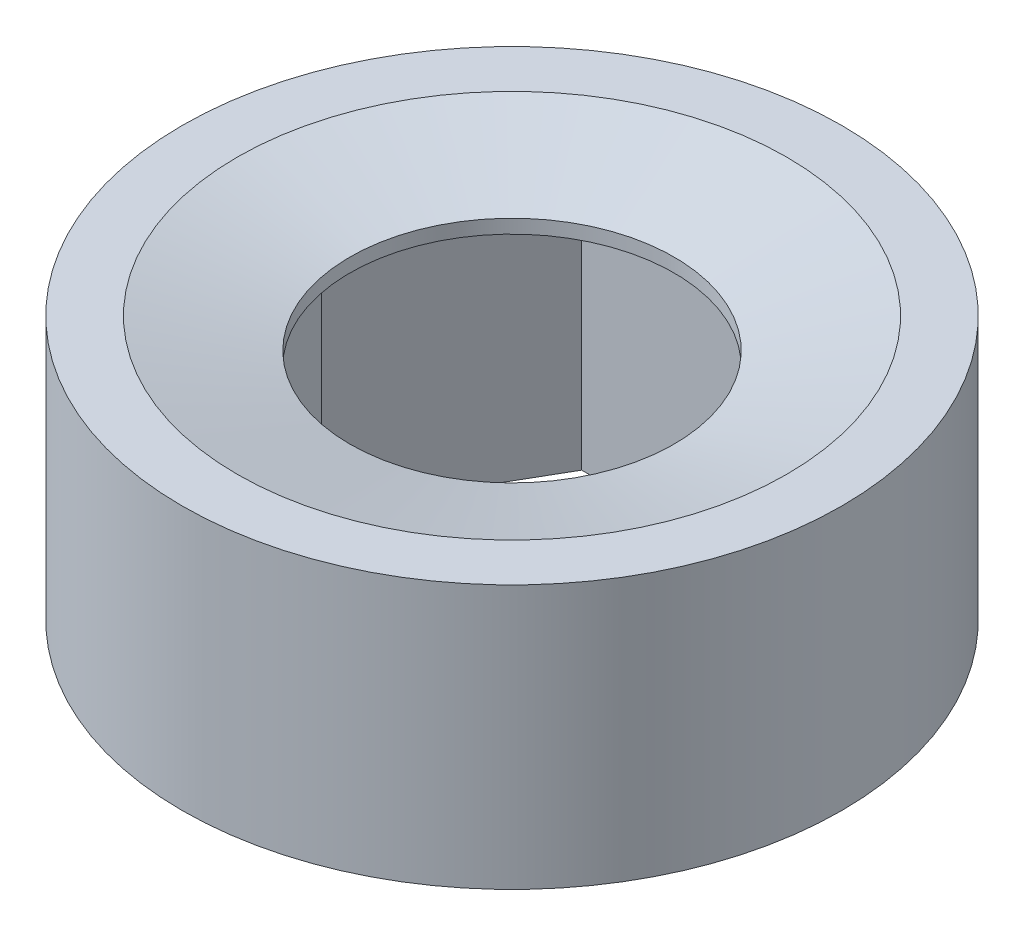
ISO-10303-21;
HEADER;
FILE_DESCRIPTION(('STEP AP214'),'2;1');
FILE_NAME('part.step','',(''),(''),'','','');
FILE_SCHEMA(('AUTOMOTIVE_DESIGN { 1 0 10303 214 1 1 1 1 }'));
ENDSEC;
DATA;
#1=APPLICATION_CONTEXT('core data for automotive mechanical design processes');
#2=APPLICATION_PROTOCOL_DEFINITION('international standard','automotive_design',2000,#1);
#3=PRODUCT_CONTEXT('',#1,'mechanical');
#4=PRODUCT('Part','Part','',(#3));
#5=PRODUCT_RELATED_PRODUCT_CATEGORY('part','',(#4));
#6=PRODUCT_DEFINITION_FORMATION('','',#4);
#7=PRODUCT_DEFINITION_CONTEXT('part definition',#1,'design');
#8=PRODUCT_DEFINITION('design','',#6,#7);
#9=PRODUCT_DEFINITION_SHAPE('','',#8);
#10=(LENGTH_UNIT() NAMED_UNIT(*) SI_UNIT(.MILLI.,.METRE.));
#11=(NAMED_UNIT(*) PLANE_ANGLE_UNIT() SI_UNIT($,.RADIAN.));
#12=(NAMED_UNIT(*) SI_UNIT($,.STERADIAN.) SOLID_ANGLE_UNIT());
#13=UNCERTAINTY_MEASURE_WITH_UNIT(LENGTH_MEASURE(1.E-05),#10,'distance_accuracy_value','');
#14=(GEOMETRIC_REPRESENTATION_CONTEXT(3) GLOBAL_UNCERTAINTY_ASSIGNED_CONTEXT((#13)) GLOBAL_UNIT_ASSIGNED_CONTEXT((#10,
#11,#12)) REPRESENTATION_CONTEXT('',''));
#15=CARTESIAN_POINT('',(0.,0.,0.));
#16=DIRECTION('',(0.,0.,1.));
#17=DIRECTION('',(1.,0.,0.));
#18=AXIS2_PLACEMENT_3D('',#15,#16,#17);
#19=CARTESIAN_POINT('',(0.,0.,0.));
#20=DIRECTION('',(0.,1.,0.));
#21=DIRECTION('',(0.,0.,1.));
#22=AXIS2_PLACEMENT_3D('',#19,#20,#21);
#23=PLANE('',#22);
#24=CARTESIAN_POINT('',(0.,0.,0.));
#25=DIRECTION('',(0.,1.,0.));
#26=DIRECTION('',(0.,0.,1.));
#27=AXIS2_PLACEMENT_3D('',#24,#25,#26);
#28=CIRCLE('',#27,12.);
#29=CARTESIAN_POINT('',(0.,0.,12.));
#30=VERTEX_POINT('',#29);
#31=EDGE_CURVE('E11',#30,#30,#28,.T.);
#32=ORIENTED_EDGE('',*,*,#31,.F.);
#33=EDGE_LOOP('',(#32));
#34=FACE_BOUND('',#33,.T.);
#35=DIRECTION('',(-0.5,0.,-0.866025403784438));
#36=VECTOR('',#35,1.);
#37=CARTESIAN_POINT('',(6.92820323027551,0.,0.));
#38=LINE('',#37,#36);
#39=CARTESIAN_POINT('',(6.92820323027551,0.,0.));
#40=VERTEX_POINT('',#39);
#41=CARTESIAN_POINT('',(3.46410161513775,0.,-6.));
#42=VERTEX_POINT('',#41);
#43=EDGE_CURVE('E56',#40,#42,#38,.T.);
#44=ORIENTED_EDGE('',*,*,#43,.T.);
#45=DIRECTION('',(-1.,0.,0.));
#46=VECTOR('',#45,1.);
#47=CARTESIAN_POINT('',(3.46410161513775,0.,-6.));
#48=LINE('',#47,#46);
#49=CARTESIAN_POINT('',(-3.46410161513775,0.,-6.));
#50=VERTEX_POINT('',#49);
#51=EDGE_CURVE('E118',#42,#50,#48,.T.);
#52=ORIENTED_EDGE('',*,*,#51,.T.);
#53=DIRECTION('',(-0.5,0.,0.866025403784439));
#54=VECTOR('',#53,1.);
#55=CARTESIAN_POINT('',(-3.46410161513775,0.,-6.));
#56=LINE('',#55,#54);
#57=CARTESIAN_POINT('',(-6.92820323027551,0.,0.));
#58=VERTEX_POINT('',#57);
#59=EDGE_CURVE('E112',#50,#58,#56,.T.);
#60=ORIENTED_EDGE('',*,*,#59,.T.);
#61=DIRECTION('',(0.5,0.,0.866025403784438));
#62=VECTOR('',#61,1.);
#63=CARTESIAN_POINT('',(-6.92820323027551,0.,0.));
#64=LINE('',#63,#62);
#65=CARTESIAN_POINT('',(-3.46410161513775,0.,6.));
#66=VERTEX_POINT('',#65);
#67=EDGE_CURVE('E91',#58,#66,#64,.T.);
#68=ORIENTED_EDGE('',*,*,#67,.T.);
#69=DIRECTION('',(1.,0.,0.));
#70=VECTOR('',#69,1.);
#71=CARTESIAN_POINT('',(-3.46410161513775,0.,6.));
#72=LINE('',#71,#70);
#73=CARTESIAN_POINT('',(3.46410161513776,0.,6.));
#74=VERTEX_POINT('',#73);
#75=EDGE_CURVE('E101',#66,#74,#72,.T.);
#76=ORIENTED_EDGE('',*,*,#75,.T.);
#77=DIRECTION('',(0.5,0.,-0.866025403784439));
#78=VECTOR('',#77,1.);
#79=CARTESIAN_POINT('',(3.46410161513776,0.,6.));
#80=LINE('',#79,#78);
#81=EDGE_CURVE('E108',#74,#40,#80,.T.);
#82=ORIENTED_EDGE('',*,*,#81,.T.);
#83=EDGE_LOOP('',(#44,#52,#60,#68,#76,#82));
#84=FACE_BOUND('',#83,.T.);
#85=ADVANCED_FACE('F39',(#34,#84),#23,.F.);
#86=CARTESIAN_POINT('',(0.,8.,0.));
#87=DIRECTION('',(0.,-1.,0.));
#88=DIRECTION('',(0.,0.,-1.));
#89=AXIS2_PLACEMENT_3D('',#86,#87,#88);
#90=CYLINDRICAL_SURFACE('',#89,12.);
#91=ORIENTED_EDGE('',*,*,#31,.T.);
#92=EDGE_LOOP('',(#91));
#93=FACE_BOUND('',#92,.T.);
#94=CARTESIAN_POINT('',(0.,9.6,0.));
#95=DIRECTION('',(0.,1.,0.));
#96=DIRECTION('',(0.,0.,1.));
#97=AXIS2_PLACEMENT_3D('',#94,#95,#96);
#98=CIRCLE('',#97,12.);
#99=CARTESIAN_POINT('',(0.,9.6,12.));
#100=VERTEX_POINT('',#99);
#101=EDGE_CURVE('E144',#100,#100,#98,.T.);
#102=ORIENTED_EDGE('',*,*,#101,.F.);
#103=EDGE_LOOP('',(#102));
#104=FACE_BOUND('',#103,.T.);
#105=ADVANCED_FACE('F41',(#93,#104),#90,.T.);
#106=CARTESIAN_POINT('',(6.92820323027551,8.,0.));
#107=DIRECTION('',(-0.866025403784439,0.,0.5));
#108=DIRECTION('',(0.5,0.,0.866025403784438));
#109=AXIS2_PLACEMENT_3D('',#106,#107,#108);
#110=PLANE('',#109);
#111=ORIENTED_EDGE('',*,*,#43,.F.);
#112=DIRECTION('',(0.,-1.,0.));
#113=VECTOR('',#112,1.);
#114=CARTESIAN_POINT('',(6.92820323027551,8.,0.));
#115=LINE('',#114,#113);
#116=CARTESIAN_POINT('',(6.92820323027551,8.,0.));
#117=VERTEX_POINT('',#116);
#118=EDGE_CURVE('E125',#117,#40,#115,.T.);
#119=ORIENTED_EDGE('',*,*,#118,.F.);
#120=DIRECTION('',(-0.5,0.,-0.866025403784438));
#121=VECTOR('',#120,1.);
#122=CARTESIAN_POINT('',(6.92820323027551,8.,0.));
#123=LINE('',#122,#121);
#124=CARTESIAN_POINT('',(3.46410161513775,8.,-6.));
#125=VERTEX_POINT('',#124);
#126=EDGE_CURVE('E124',#117,#125,#123,.T.);
#127=ORIENTED_EDGE('',*,*,#126,.T.);
#128=DIRECTION('',(0.,-1.,0.));
#129=VECTOR('',#128,1.);
#130=CARTESIAN_POINT('',(3.46410161513775,8.,-6.));
#131=LINE('',#130,#129);
#132=EDGE_CURVE('E49',#125,#42,#131,.T.);
#133=ORIENTED_EDGE('',*,*,#132,.T.);
#134=EDGE_LOOP('',(#111,#119,#127,#133));
#135=FACE_BOUND('',#134,.T.);
#136=ADVANCED_FACE('F139',(#135),#110,.T.);
#137=CARTESIAN_POINT('',(3.46410161513775,8.,-6.));
#138=DIRECTION('',(0.,0.,1.));
#139=DIRECTION('',(1.,0.,0.));
#140=AXIS2_PLACEMENT_3D('',#137,#138,#139);
#141=PLANE('',#140);
#142=ORIENTED_EDGE('',*,*,#51,.F.);
#143=ORIENTED_EDGE('',*,*,#132,.F.);
#144=DIRECTION('',(-1.,0.,0.));
#145=VECTOR('',#144,1.);
#146=CARTESIAN_POINT('',(3.46410161513775,8.,-6.));
#147=LINE('',#146,#145);
#148=CARTESIAN_POINT('',(-3.46410161513775,8.,-6.));
#149=VERTEX_POINT('',#148);
#150=EDGE_CURVE('E163',#125,#149,#147,.T.);
#151=ORIENTED_EDGE('',*,*,#150,.T.);
#152=DIRECTION('',(0.,-1.,0.));
#153=VECTOR('',#152,1.);
#154=CARTESIAN_POINT('',(-3.46410161513775,8.,-6.));
#155=LINE('',#154,#153);
#156=EDGE_CURVE('E133',#149,#50,#155,.T.);
#157=ORIENTED_EDGE('',*,*,#156,.T.);
#158=EDGE_LOOP('',(#142,#143,#151,#157));
#159=FACE_BOUND('',#158,.T.);
#160=ADVANCED_FACE('F208',(#159),#141,.T.);
#161=CARTESIAN_POINT('',(-3.46410161513775,8.,-6.));
#162=DIRECTION('',(0.866025403784439,0.,0.5));
#163=DIRECTION('',(0.5,0.,-0.866025403784439));
#164=AXIS2_PLACEMENT_3D('',#161,#162,#163);
#165=PLANE('',#164);
#166=ORIENTED_EDGE('',*,*,#59,.F.);
#167=ORIENTED_EDGE('',*,*,#156,.F.);
#168=DIRECTION('',(-0.5,0.,0.866025403784439));
#169=VECTOR('',#168,1.);
#170=CARTESIAN_POINT('',(-3.46410161513775,8.,-6.));
#171=LINE('',#170,#169);
#172=CARTESIAN_POINT('',(-6.92820323027551,8.,0.));
#173=VERTEX_POINT('',#172);
#174=EDGE_CURVE('E160',#149,#173,#171,.T.);
#175=ORIENTED_EDGE('',*,*,#174,.T.);
#176=DIRECTION('',(0.,-1.,0.));
#177=VECTOR('',#176,1.);
#178=CARTESIAN_POINT('',(-6.92820323027551,8.,0.));
#179=LINE('',#178,#177);
#180=EDGE_CURVE('E97',#173,#58,#179,.T.);
#181=ORIENTED_EDGE('',*,*,#180,.T.);
#182=EDGE_LOOP('',(#166,#167,#175,#181));
#183=FACE_BOUND('',#182,.T.);
#184=ADVANCED_FACE('F211',(#183),#165,.T.);
#185=CARTESIAN_POINT('',(-6.92820323027551,8.,0.));
#186=DIRECTION('',(0.866025403784438,0.,-0.5));
#187=DIRECTION('',(-0.5,0.,-0.866025403784439));
#188=AXIS2_PLACEMENT_3D('',#185,#186,#187);
#189=PLANE('',#188);
#190=ORIENTED_EDGE('',*,*,#67,.F.);
#191=ORIENTED_EDGE('',*,*,#180,.F.);
#192=DIRECTION('',(0.5,0.,0.866025403784438));
#193=VECTOR('',#192,1.);
#194=CARTESIAN_POINT('',(-6.92820323027551,8.,0.));
#195=LINE('',#194,#193);
#196=CARTESIAN_POINT('',(-3.46410161513775,8.,6.));
#197=VERTEX_POINT('',#196);
#198=EDGE_CURVE('E65',#173,#197,#195,.T.);
#199=ORIENTED_EDGE('',*,*,#198,.T.);
#200=DIRECTION('',(0.,-1.,0.));
#201=VECTOR('',#200,1.);
#202=CARTESIAN_POINT('',(-3.46410161513775,8.,6.));
#203=LINE('',#202,#201);
#204=EDGE_CURVE('E86',#197,#66,#203,.T.);
#205=ORIENTED_EDGE('',*,*,#204,.T.);
#206=EDGE_LOOP('',(#190,#191,#199,#205));
#207=FACE_BOUND('',#206,.T.);
#208=ADVANCED_FACE('F88',(#207),#189,.T.);
#209=CARTESIAN_POINT('',(-3.46410161513775,8.,6.));
#210=DIRECTION('',(0.,0.,-1.));
#211=DIRECTION('',(-1.,0.,0.));
#212=AXIS2_PLACEMENT_3D('',#209,#210,#211);
#213=PLANE('',#212);
#214=ORIENTED_EDGE('',*,*,#75,.F.);
#215=ORIENTED_EDGE('',*,*,#204,.F.);
#216=DIRECTION('',(1.,0.,0.));
#217=VECTOR('',#216,1.);
#218=CARTESIAN_POINT('',(-3.46410161513775,8.,6.));
#219=LINE('',#218,#217);
#220=CARTESIAN_POINT('',(3.46410161513776,8.,6.));
#221=VERTEX_POINT('',#220);
#222=EDGE_CURVE('E155',#197,#221,#219,.T.);
#223=ORIENTED_EDGE('',*,*,#222,.T.);
#224=DIRECTION('',(0.,-1.,0.));
#225=VECTOR('',#224,1.);
#226=CARTESIAN_POINT('',(3.46410161513776,8.,6.));
#227=LINE('',#226,#225);
#228=EDGE_CURVE('E98',#221,#74,#227,.T.);
#229=ORIENTED_EDGE('',*,*,#228,.T.);
#230=EDGE_LOOP('',(#214,#215,#223,#229));
#231=FACE_BOUND('',#230,.T.);
#232=ADVANCED_FACE('F102',(#231),#213,.T.);
#233=CARTESIAN_POINT('',(3.46410161513776,8.,6.));
#234=DIRECTION('',(-0.866025403784439,0.,-0.5));
#235=DIRECTION('',(-0.5,0.,0.866025403784439));
#236=AXIS2_PLACEMENT_3D('',#233,#234,#235);
#237=PLANE('',#236);
#238=ORIENTED_EDGE('',*,*,#81,.F.);
#239=ORIENTED_EDGE('',*,*,#228,.F.);
#240=DIRECTION('',(0.5,0.,-0.866025403784439));
#241=VECTOR('',#240,1.);
#242=CARTESIAN_POINT('',(3.46410161513776,8.,6.));
#243=LINE('',#242,#241);
#244=EDGE_CURVE('E128',#221,#117,#243,.T.);
#245=ORIENTED_EDGE('',*,*,#244,.T.);
#246=ORIENTED_EDGE('',*,*,#118,.T.);
#247=EDGE_LOOP('',(#238,#239,#245,#246));
#248=FACE_BOUND('',#247,.T.);
#249=ADVANCED_FACE('F193',(#248),#237,.T.);
#250=CARTESIAN_POINT('',(0.,9.6,0.));
#251=DIRECTION('',(0.,1.,0.));
#252=DIRECTION('',(0.,0.,1.));
#253=AXIS2_PLACEMENT_3D('',#250,#251,#252);
#254=PLANE('',#253);
#255=CARTESIAN_POINT('',(0.,9.6,0.));
#256=DIRECTION('',(0.,1.,0.));
#257=DIRECTION('',(0.,0.,1.));
#258=AXIS2_PLACEMENT_3D('',#255,#256,#257);
#259=CIRCLE('',#258,10.);
#260=CARTESIAN_POINT('',(0.,9.6,10.));
#261=VERTEX_POINT('',#260);
#262=EDGE_CURVE('E170',#261,#261,#259,.T.);
#263=ORIENTED_EDGE('',*,*,#262,.F.);
#264=EDGE_LOOP('',(#263));
#265=FACE_BOUND('',#264,.T.);
#266=ORIENTED_EDGE('',*,*,#101,.T.);
#267=EDGE_LOOP('',(#266));
#268=FACE_BOUND('',#267,.T.);
#269=ADVANCED_FACE('F188',(#265,#268),#254,.T.);
#270=CARTESIAN_POINT('',(0.,8.,0.));
#271=DIRECTION('',(0.,1.,0.));
#272=DIRECTION('',(0.,0.,1.));
#273=AXIS2_PLACEMENT_3D('',#270,#271,#272);
#274=PLANE('',#273);
#275=ORIENTED_EDGE('',*,*,#150,.F.);
#276=ORIENTED_EDGE('',*,*,#126,.F.);
#277=ORIENTED_EDGE('',*,*,#244,.F.);
#278=ORIENTED_EDGE('',*,*,#222,.F.);
#279=ORIENTED_EDGE('',*,*,#198,.F.);
#280=ORIENTED_EDGE('',*,*,#174,.F.);
#281=EDGE_LOOP('',(#275,#276,#277,#278,#279,#280));
#282=FACE_BOUND('',#281,.T.);
#283=CARTESIAN_POINT('',(0.,8.,0.));
#284=DIRECTION('',(0.,1.,0.));
#285=DIRECTION('',(0.,0.,1.));
#286=AXIS2_PLACEMENT_3D('',#283,#284,#285);
#287=CIRCLE('',#286,5.9);
#288=CARTESIAN_POINT('',(0.,8.,5.9));
#289=VERTEX_POINT('',#288);
#290=EDGE_CURVE('E149',#289,#289,#287,.T.);
#291=ORIENTED_EDGE('',*,*,#290,.T.);
#292=EDGE_LOOP('',(#291));
#293=FACE_BOUND('',#292,.T.);
#294=ADVANCED_FACE('F183',(#282,#293),#274,.F.);
#295=CARTESIAN_POINT('',(0.,9.6,0.));
#296=DIRECTION('',(0.,-1.,0.));
#297=DIRECTION('',(0.,0.,-1.));
#298=AXIS2_PLACEMENT_3D('',#295,#296,#297);
#299=CYLINDRICAL_SURFACE('',#298,5.9);
#300=CARTESIAN_POINT('',(0.,8.50140831103241,0.));
#301=DIRECTION('',(0.,1.,0.));
#302=DIRECTION('',(0.,0.,1.));
#303=AXIS2_PLACEMENT_3D('',#300,#301,#302);
#304=CIRCLE('',#303,5.9);
#305=CARTESIAN_POINT('',(0.,8.50140831103241,5.9));
#306=VERTEX_POINT('',#305);
#307=EDGE_CURVE('E43',#306,#306,#304,.F.);
#308=ORIENTED_EDGE('',*,*,#307,.F.);
#309=EDGE_LOOP('',(#308));
#310=FACE_BOUND('',#309,.T.);
#311=ORIENTED_EDGE('',*,*,#290,.F.);
#312=EDGE_LOOP('',(#311));
#313=FACE_BOUND('',#312,.T.);
#314=ADVANCED_FACE('F180',(#310,#313),#299,.F.);
#315=CARTESIAN_POINT('',(0.,9.6,0.));
#316=DIRECTION('',(0.,1.,0.));
#317=DIRECTION('',(0.,0.,1.));
#318=AXIS2_PLACEMENT_3D('',#315,#316,#317);
#319=CONICAL_SURFACE('',#318,10.,1.30899693899575);
#320=ORIENTED_EDGE('',*,*,#307,.T.);
#321=EDGE_LOOP('',(#320));
#322=FACE_BOUND('',#321,.T.);
#323=ORIENTED_EDGE('',*,*,#262,.T.);
#324=EDGE_LOOP('',(#323));
#325=FACE_BOUND('',#324,.T.);
#326=ADVANCED_FACE('F178',(#322,#325),#319,.F.);
#327=CLOSED_SHELL('',(#85,#105,#136,#160,#184,#208,#232,#249,#269,#294,#314,#326));
#328=MANIFOLD_SOLID_BREP('B2',#327);
#329=ADVANCED_BREP_SHAPE_REPRESENTATION('',(#18,#328),#14);
#330=SHAPE_DEFINITION_REPRESENTATION(#9,#329);
ENDSEC;
END-ISO-10303-21;
